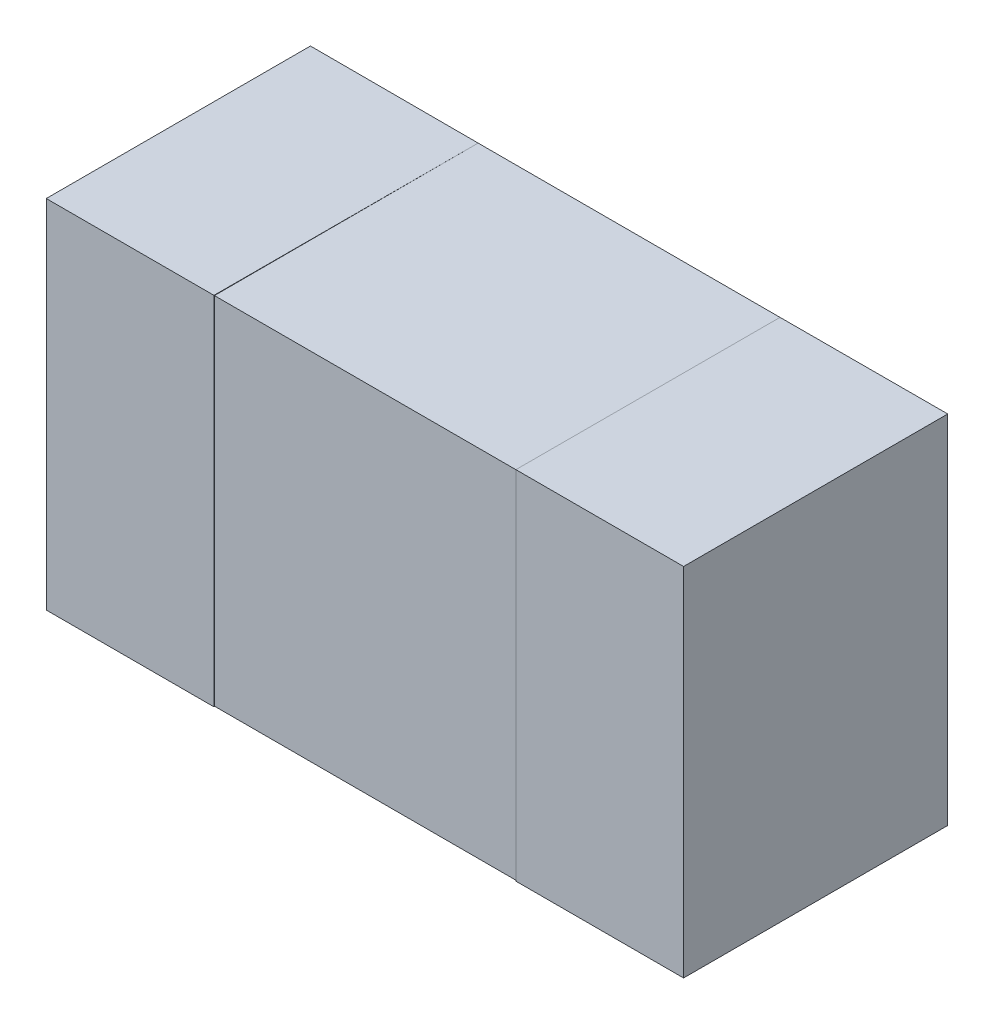
ISO-10303-21;
HEADER;
FILE_DESCRIPTION(('STEP AP214'),'2;1');
FILE_NAME('part.step','',(''),(''),'','','');
FILE_SCHEMA(('AUTOMOTIVE_DESIGN { 1 0 10303 214 1 1 1 1 }'));
ENDSEC;
DATA;
#1=APPLICATION_CONTEXT('core data for automotive mechanical design processes');
#2=APPLICATION_PROTOCOL_DEFINITION('international standard','automotive_design',2000,#1);
#3=PRODUCT_CONTEXT('',#1,'mechanical');
#4=PRODUCT('Part','Part','',(#3));
#5=PRODUCT_RELATED_PRODUCT_CATEGORY('part','',(#4));
#6=PRODUCT_DEFINITION_FORMATION('','',#4);
#7=PRODUCT_DEFINITION_CONTEXT('part definition',#1,'design');
#8=PRODUCT_DEFINITION('design','',#6,#7);
#9=PRODUCT_DEFINITION_SHAPE('','',#8);
#10=(LENGTH_UNIT() NAMED_UNIT(*) SI_UNIT(.MILLI.,.METRE.));
#11=(NAMED_UNIT(*) PLANE_ANGLE_UNIT() SI_UNIT($,.RADIAN.));
#12=(NAMED_UNIT(*) SI_UNIT($,.STERADIAN.) SOLID_ANGLE_UNIT());
#13=UNCERTAINTY_MEASURE_WITH_UNIT(LENGTH_MEASURE(1.E-05),#10,'distance_accuracy_value','');
#14=(GEOMETRIC_REPRESENTATION_CONTEXT(3) GLOBAL_UNCERTAINTY_ASSIGNED_CONTEXT((#13)) GLOBAL_UNIT_ASSIGNED_CONTEXT((#10,
#11,#12)) REPRESENTATION_CONTEXT('',''));
#15=CARTESIAN_POINT('',(0.,0.,0.));
#16=DIRECTION('',(0.,0.,1.));
#17=DIRECTION('',(1.,0.,0.));
#18=AXIS2_PLACEMENT_3D('',#15,#16,#17);
#19=CARTESIAN_POINT('',(0.358999999999954,-0.426,0.63));
#20=DIRECTION('',(0.,0.,1.));
#21=DIRECTION('',(1.,0.,0.));
#22=AXIS2_PLACEMENT_3D('',#19,#20,#21);
#23=PLANE('',#22);
#24=DIRECTION('',(0.,-1.,0.));
#25=VECTOR('',#24,1.);
#26=CARTESIAN_POINT('',(0.76,0.,0.63));
#27=LINE('',#26,#25);
#28=CARTESIAN_POINT('',(0.76,0.425,0.63));
#29=VERTEX_POINT('',#28);
#30=CARTESIAN_POINT('',(0.76,-0.425,0.63));
#31=VERTEX_POINT('',#30);
#32=EDGE_CURVE('E178',#29,#31,#27,.T.);
#33=ORIENTED_EDGE('',*,*,#32,.F.);
#34=DIRECTION('',(1.,0.,0.));
#35=VECTOR('',#34,1.);
#36=CARTESIAN_POINT('',(0.56,0.425,0.63));
#37=LINE('',#36,#35);
#38=CARTESIAN_POINT('',(0.36,0.425,0.63));
#39=VERTEX_POINT('',#38);
#40=EDGE_CURVE('E179',#39,#29,#37,.T.);
#41=ORIENTED_EDGE('',*,*,#40,.F.);
#42=DIRECTION('',(0.,-1.,0.));
#43=VECTOR('',#42,1.);
#44=CARTESIAN_POINT('',(0.36,0.426,0.63));
#45=LINE('',#44,#43);
#46=CARTESIAN_POINT('',(0.359999999999954,-0.425,0.63));
#47=VERTEX_POINT('',#46);
#48=EDGE_CURVE('E20',#47,#39,#45,.F.);
#49=ORIENTED_EDGE('',*,*,#48,.F.);
#50=DIRECTION('',(-1.,0.,0.));
#51=VECTOR('',#50,1.);
#52=CARTESIAN_POINT('',(0.56,-0.425,0.63));
#53=LINE('',#52,#51);
#54=EDGE_CURVE('E184',#31,#47,#53,.T.);
#55=ORIENTED_EDGE('',*,*,#54,.F.);
#56=EDGE_LOOP('',(#33,#41,#49,#55));
#57=FACE_BOUND('',#56,.T.);
#58=ADVANCED_FACE('F16',(#57),#23,.T.);
#59=CARTESIAN_POINT('',(0.36,0.426,-0.00100000000000003));
#60=DIRECTION('',(-1.,0.,0.));
#61=DIRECTION('',(0.,-1.,0.));
#62=AXIS2_PLACEMENT_3D('',#59,#60,#61);
#63=PLANE('',#62);
#64=DIRECTION('',(0.,0.,-1.));
#65=VECTOR('',#64,1.);
#66=CARTESIAN_POINT('',(0.359999999999954,-0.425,0.631));
#67=LINE('',#66,#65);
#68=CARTESIAN_POINT('',(0.359999999999985,-0.4245,0.));
#69=VERTEX_POINT('',#68);
#70=EDGE_CURVE('E168',#47,#69,#67,.T.);
#71=ORIENTED_EDGE('',*,*,#70,.F.);
#72=ORIENTED_EDGE('',*,*,#48,.T.);
#73=DIRECTION('',(0.,0.,1.));
#74=VECTOR('',#73,1.);
#75=CARTESIAN_POINT('',(0.36,0.425,-0.00100000000000003));
#76=LINE('',#75,#74);
#77=CARTESIAN_POINT('',(0.36,0.4245,0.));
#78=VERTEX_POINT('',#77);
#79=EDGE_CURVE('E191',#78,#39,#76,.T.);
#80=ORIENTED_EDGE('',*,*,#79,.F.);
#81=DIRECTION('',(0.,0.,1.));
#82=VECTOR('',#81,1.);
#83=CARTESIAN_POINT('',(0.36,0.424,-0.00100000000000003));
#84=LINE('',#83,#82);
#85=CARTESIAN_POINT('',(0.359999999999977,0.424,0.629));
#86=VERTEX_POINT('',#85);
#87=EDGE_CURVE('E35',#86,#78,#84,.F.);
#88=ORIENTED_EDGE('',*,*,#87,.F.);
#89=DIRECTION('',(0.,1.,0.));
#90=VECTOR('',#89,1.);
#91=CARTESIAN_POINT('',(0.359999999999954,-0.425,0.629));
#92=LINE('',#91,#90);
#93=CARTESIAN_POINT('',(0.359999999999954,-0.424,0.629));
#94=VERTEX_POINT('',#93);
#95=EDGE_CURVE('E163',#94,#86,#92,.T.);
#96=ORIENTED_EDGE('',*,*,#95,.F.);
#97=DIRECTION('',(0.,0.,-1.));
#98=VECTOR('',#97,1.);
#99=CARTESIAN_POINT('',(0.359999999999954,-0.424,0.63));
#100=LINE('',#99,#98);
#101=EDGE_CURVE('E214',#69,#94,#100,.F.);
#102=ORIENTED_EDGE('',*,*,#101,.F.);
#103=EDGE_LOOP('',(#71,#72,#80,#88,#96,#102));
#104=FACE_BOUND('',#103,.T.);
#105=ADVANCED_FACE('F234',(#104),#63,.T.);
#106=CARTESIAN_POINT('',(0.359,0.425,-0.00100000000000003));
#107=DIRECTION('',(0.,1.,0.));
#108=DIRECTION('',(0.,0.,1.));
#109=AXIS2_PLACEMENT_3D('',#106,#107,#108);
#110=PLANE('',#109);
#111=ORIENTED_EDGE('',*,*,#40,.T.);
#112=DIRECTION('',(0.,0.,1.));
#113=VECTOR('',#112,1.);
#114=CARTESIAN_POINT('',(0.76,0.425,0.315));
#115=LINE('',#114,#113);
#116=CARTESIAN_POINT('',(0.76,0.425,0.));
#117=VERTEX_POINT('',#116);
#118=EDGE_CURVE('E175',#117,#29,#115,.T.);
#119=ORIENTED_EDGE('',*,*,#118,.F.);
#120=DIRECTION('',(1.,0.,0.));
#121=VECTOR('',#120,1.);
#122=CARTESIAN_POINT('',(0.,0.425,0.));
#123=LINE('',#122,#121);
#124=EDGE_CURVE('E139',#78,#117,#123,.T.);
#125=ORIENTED_EDGE('',*,*,#124,.F.);
#126=ORIENTED_EDGE('',*,*,#79,.T.);
#127=EDGE_LOOP('',(#111,#119,#125,#126));
#128=FACE_BOUND('',#127,.T.);
#129=ADVANCED_FACE('F237',(#128),#110,.T.);
#130=CARTESIAN_POINT('',(0.76,-0.426,0.631));
#131=DIRECTION('',(1.,0.,0.));
#132=DIRECTION('',(0.,0.,-1.));
#133=AXIS2_PLACEMENT_3D('',#130,#131,#132);
#134=PLANE('',#133);
#135=ORIENTED_EDGE('',*,*,#32,.T.);
#136=DIRECTION('',(0.,0.,1.));
#137=VECTOR('',#136,1.);
#138=CARTESIAN_POINT('',(0.76,-0.425,0.315));
#139=LINE('',#138,#137);
#140=CARTESIAN_POINT('',(0.76,-0.425,0.));
#141=VERTEX_POINT('',#140);
#142=EDGE_CURVE('E165',#141,#31,#139,.T.);
#143=ORIENTED_EDGE('',*,*,#142,.F.);
#144=DIRECTION('',(0.,-1.,0.));
#145=VECTOR('',#144,1.);
#146=CARTESIAN_POINT('',(0.76,0.,0.));
#147=LINE('',#146,#145);
#148=EDGE_CURVE('E136',#117,#141,#147,.T.);
#149=ORIENTED_EDGE('',*,*,#148,.F.);
#150=ORIENTED_EDGE('',*,*,#118,.T.);
#151=EDGE_LOOP('',(#135,#143,#149,#150));
#152=FACE_BOUND('',#151,.T.);
#153=ADVANCED_FACE('F240',(#152),#134,.T.);
#154=CARTESIAN_POINT('',(0.359,-0.425,0.631));
#155=DIRECTION('',(0.,-1.,0.));
#156=DIRECTION('',(0.,0.,-1.));
#157=AXIS2_PLACEMENT_3D('',#154,#155,#156);
#158=PLANE('',#157);
#159=DIRECTION('',(-1.,0.,0.));
#160=VECTOR('',#159,1.);
#161=CARTESIAN_POINT('',(0.,-0.425,0.));
#162=LINE('',#161,#160);
#163=EDGE_CURVE('E128',#141,#69,#162,.T.);
#164=ORIENTED_EDGE('',*,*,#163,.F.);
#165=ORIENTED_EDGE('',*,*,#142,.T.);
#166=ORIENTED_EDGE('',*,*,#54,.T.);
#167=ORIENTED_EDGE('',*,*,#70,.T.);
#168=EDGE_LOOP('',(#164,#165,#166,#167));
#169=FACE_BOUND('',#168,.T.);
#170=ADVANCED_FACE('F258',(#169),#158,.T.);
#171=CARTESIAN_POINT('',(-0.361,0.424,-0.00100000000000003));
#172=DIRECTION('',(0.,1.,0.));
#173=DIRECTION('',(0.,0.,1.));
#174=AXIS2_PLACEMENT_3D('',#171,#172,#173);
#175=PLANE('',#174);
#176=ORIENTED_EDGE('',*,*,#87,.T.);
#177=DIRECTION('',(1.,0.,0.));
#178=VECTOR('',#177,1.);
#179=CARTESIAN_POINT('',(0.,0.424,0.));
#180=LINE('',#179,#178);
#181=CARTESIAN_POINT('',(-0.36,0.4245,0.));
#182=VERTEX_POINT('',#181);
#183=EDGE_CURVE('E142',#182,#78,#180,.T.);
#184=ORIENTED_EDGE('',*,*,#183,.F.);
#185=DIRECTION('',(0.,0.,-1.));
#186=VECTOR('',#185,1.);
#187=CARTESIAN_POINT('',(-0.36,0.424,0.631));
#188=LINE('',#187,#186);
#189=CARTESIAN_POINT('',(-0.36,0.424,0.629));
#190=VERTEX_POINT('',#189);
#191=EDGE_CURVE('E127',#190,#182,#188,.T.);
#192=ORIENTED_EDGE('',*,*,#191,.F.);
#193=DIRECTION('',(-1.,0.,0.));
#194=VECTOR('',#193,1.);
#195=CARTESIAN_POINT('',(0.,0.424,0.629));
#196=LINE('',#195,#194);
#197=EDGE_CURVE('E160',#86,#190,#196,.T.);
#198=ORIENTED_EDGE('',*,*,#197,.F.);
#199=EDGE_LOOP('',(#176,#184,#192,#198));
#200=FACE_BOUND('',#199,.T.);
#201=ADVANCED_FACE('F246',(#200),#175,.T.);
#202=CARTESIAN_POINT('',(-0.361,-0.424,0.63));
#203=DIRECTION('',(0.,-1.,0.));
#204=DIRECTION('',(0.,0.,-1.));
#205=AXIS2_PLACEMENT_3D('',#202,#203,#204);
#206=PLANE('',#205);
#207=DIRECTION('',(0.,0.,-1.));
#208=VECTOR('',#207,1.);
#209=CARTESIAN_POINT('',(-0.36,-0.424,0.631));
#210=LINE('',#209,#208);
#211=CARTESIAN_POINT('',(-0.36,-0.4245,0.));
#212=VERTEX_POINT('',#211);
#213=CARTESIAN_POINT('',(-0.36,-0.424,0.629));
#214=VERTEX_POINT('',#213);
#215=EDGE_CURVE('E199',#212,#214,#210,.F.);
#216=ORIENTED_EDGE('',*,*,#215,.F.);
#217=DIRECTION('',(-1.,0.,0.));
#218=VECTOR('',#217,1.);
#219=CARTESIAN_POINT('',(0.,-0.424,0.));
#220=LINE('',#219,#218);
#221=EDGE_CURVE('E147',#69,#212,#220,.T.);
#222=ORIENTED_EDGE('',*,*,#221,.F.);
#223=ORIENTED_EDGE('',*,*,#101,.T.);
#224=DIRECTION('',(1.,0.,0.));
#225=VECTOR('',#224,1.);
#226=CARTESIAN_POINT('',(0.,-0.424,0.629));
#227=LINE('',#226,#225);
#228=EDGE_CURVE('E151',#214,#94,#227,.T.);
#229=ORIENTED_EDGE('',*,*,#228,.F.);
#230=EDGE_LOOP('',(#216,#222,#223,#229));
#231=FACE_BOUND('',#230,.T.);
#232=ADVANCED_FACE('F256',(#231),#206,.T.);
#233=CARTESIAN_POINT('',(-0.361,-0.425,0.629));
#234=DIRECTION('',(0.,0.,1.));
#235=DIRECTION('',(1.,0.,0.));
#236=AXIS2_PLACEMENT_3D('',#233,#234,#235);
#237=PLANE('',#236);
#238=DIRECTION('',(0.,1.,0.));
#239=VECTOR('',#238,1.);
#240=CARTESIAN_POINT('',(-0.36,-0.426,0.629));
#241=LINE('',#240,#239);
#242=EDGE_CURVE('E195',#214,#190,#241,.T.);
#243=ORIENTED_EDGE('',*,*,#242,.F.);
#244=ORIENTED_EDGE('',*,*,#228,.T.);
#245=ORIENTED_EDGE('',*,*,#95,.T.);
#246=ORIENTED_EDGE('',*,*,#197,.T.);
#247=EDGE_LOOP('',(#243,#244,#245,#246));
#248=FACE_BOUND('',#247,.T.);
#249=ADVANCED_FACE('F253',(#248),#237,.T.);
#250=CARTESIAN_POINT('',(0.761,-0.426,0.));
#251=DIRECTION('',(0.,0.,-1.));
#252=DIRECTION('',(-1.,0.,0.));
#253=AXIS2_PLACEMENT_3D('',#250,#251,#252);
#254=PLANE('',#253);
#255=ORIENTED_EDGE('',*,*,#148,.T.);
#256=ORIENTED_EDGE('',*,*,#163,.T.);
#257=ORIENTED_EDGE('',*,*,#221,.T.);
#258=DIRECTION('',(1.,0.,0.));
#259=VECTOR('',#258,1.);
#260=CARTESIAN_POINT('',(-0.56,-0.425,0.));
#261=LINE('',#260,#259);
#262=CARTESIAN_POINT('',(-0.76,-0.425,0.));
#263=VERTEX_POINT('',#262);
#264=EDGE_CURVE('E124',#263,#212,#261,.T.);
#265=ORIENTED_EDGE('',*,*,#264,.F.);
#266=DIRECTION('',(0.,-1.,0.));
#267=VECTOR('',#266,1.);
#268=CARTESIAN_POINT('',(-0.76,0.,0.));
#269=LINE('',#268,#267);
#270=CARTESIAN_POINT('',(-0.76,0.425,0.));
#271=VERTEX_POINT('',#270);
#272=EDGE_CURVE('E119',#271,#263,#269,.T.);
#273=ORIENTED_EDGE('',*,*,#272,.F.);
#274=DIRECTION('',(-1.,0.,0.));
#275=VECTOR('',#274,1.);
#276=CARTESIAN_POINT('',(-0.56,0.425,0.));
#277=LINE('',#276,#275);
#278=EDGE_CURVE('E99',#182,#271,#277,.T.);
#279=ORIENTED_EDGE('',*,*,#278,.F.);
#280=ORIENTED_EDGE('',*,*,#183,.T.);
#281=ORIENTED_EDGE('',*,*,#124,.T.);
#282=EDGE_LOOP('',(#255,#256,#257,#265,#273,#279,#280,#281));
#283=FACE_BOUND('',#282,.T.);
#284=ADVANCED_FACE('F243',(#283),#254,.T.);
#285=CARTESIAN_POINT('',(-0.761,-0.425,0.631));
#286=DIRECTION('',(0.,-1.,0.));
#287=DIRECTION('',(0.,0.,-1.));
#288=AXIS2_PLACEMENT_3D('',#285,#286,#287);
#289=PLANE('',#288);
#290=DIRECTION('',(1.,0.,0.));
#291=VECTOR('',#290,1.);
#292=CARTESIAN_POINT('',(-0.56,-0.425,0.63));
#293=LINE('',#292,#291);
#294=CARTESIAN_POINT('',(-0.76,-0.425,0.63));
#295=VERTEX_POINT('',#294);
#296=CARTESIAN_POINT('',(-0.36,-0.425,0.63));
#297=VERTEX_POINT('',#296);
#298=EDGE_CURVE('E102',#295,#297,#293,.T.);
#299=ORIENTED_EDGE('',*,*,#298,.F.);
#300=DIRECTION('',(0.,0.,1.));
#301=VECTOR('',#300,1.);
#302=CARTESIAN_POINT('',(-0.76,-0.425,0.315));
#303=LINE('',#302,#301);
#304=EDGE_CURVE('E103',#263,#295,#303,.T.);
#305=ORIENTED_EDGE('',*,*,#304,.F.);
#306=ORIENTED_EDGE('',*,*,#264,.T.);
#307=DIRECTION('',(0.,0.,-1.));
#308=VECTOR('',#307,1.);
#309=CARTESIAN_POINT('',(-0.36,-0.425,0.631));
#310=LINE('',#309,#308);
#311=EDGE_CURVE('E201',#297,#212,#310,.T.);
#312=ORIENTED_EDGE('',*,*,#311,.F.);
#313=EDGE_LOOP('',(#299,#305,#306,#312));
#314=FACE_BOUND('',#313,.T.);
#315=ADVANCED_FACE('F279',(#314),#289,.T.);
#316=CARTESIAN_POINT('',(-0.36,-0.426,0.631));
#317=DIRECTION('',(1.,0.,0.));
#318=DIRECTION('',(0.,0.,-1.));
#319=AXIS2_PLACEMENT_3D('',#316,#317,#318);
#320=PLANE('',#319);
#321=ORIENTED_EDGE('',*,*,#215,.T.);
#322=ORIENTED_EDGE('',*,*,#242,.T.);
#323=ORIENTED_EDGE('',*,*,#191,.T.);
#324=DIRECTION('',(0.,0.,1.));
#325=VECTOR('',#324,1.);
#326=CARTESIAN_POINT('',(-0.36,0.425,-0.00100000000000003));
#327=LINE('',#326,#325);
#328=CARTESIAN_POINT('',(-0.36,0.425,0.63));
#329=VERTEX_POINT('',#328);
#330=EDGE_CURVE('E155',#329,#182,#327,.F.);
#331=ORIENTED_EDGE('',*,*,#330,.F.);
#332=DIRECTION('',(0.,1.,0.));
#333=VECTOR('',#332,1.);
#334=CARTESIAN_POINT('',(-0.36,-0.426,0.63));
#335=LINE('',#334,#333);
#336=EDGE_CURVE('E111',#297,#329,#335,.T.);
#337=ORIENTED_EDGE('',*,*,#336,.F.);
#338=ORIENTED_EDGE('',*,*,#311,.T.);
#339=EDGE_LOOP('',(#321,#322,#323,#331,#337,#338));
#340=FACE_BOUND('',#339,.T.);
#341=ADVANCED_FACE('F248',(#340),#320,.T.);
#342=CARTESIAN_POINT('',(-0.761,0.425,-0.00100000000000003));
#343=DIRECTION('',(0.,1.,0.));
#344=DIRECTION('',(0.,0.,1.));
#345=AXIS2_PLACEMENT_3D('',#342,#343,#344);
#346=PLANE('',#345);
#347=ORIENTED_EDGE('',*,*,#278,.T.);
#348=DIRECTION('',(0.,0.,-1.));
#349=VECTOR('',#348,1.);
#350=CARTESIAN_POINT('',(-0.76,0.425,0.315));
#351=LINE('',#350,#349);
#352=CARTESIAN_POINT('',(-0.76,0.425,0.63));
#353=VERTEX_POINT('',#352);
#354=EDGE_CURVE('E92',#353,#271,#351,.T.);
#355=ORIENTED_EDGE('',*,*,#354,.F.);
#356=DIRECTION('',(-1.,0.,0.));
#357=VECTOR('',#356,1.);
#358=CARTESIAN_POINT('',(-0.56,0.425,0.63));
#359=LINE('',#358,#357);
#360=EDGE_CURVE('E26',#329,#353,#359,.T.);
#361=ORIENTED_EDGE('',*,*,#360,.F.);
#362=ORIENTED_EDGE('',*,*,#330,.T.);
#363=EDGE_LOOP('',(#347,#355,#361,#362));
#364=FACE_BOUND('',#363,.T.);
#365=ADVANCED_FACE('F94',(#364),#346,.T.);
#366=CARTESIAN_POINT('',(-0.76,0.426,-0.00100000000000003));
#367=DIRECTION('',(-1.,0.,0.));
#368=DIRECTION('',(0.,-1.,0.));
#369=AXIS2_PLACEMENT_3D('',#366,#367,#368);
#370=PLANE('',#369);
#371=DIRECTION('',(0.,-1.,0.));
#372=VECTOR('',#371,1.);
#373=CARTESIAN_POINT('',(-0.76,0.,0.63));
#374=LINE('',#373,#372);
#375=EDGE_CURVE('E11',#353,#295,#374,.T.);
#376=ORIENTED_EDGE('',*,*,#375,.F.);
#377=ORIENTED_EDGE('',*,*,#354,.T.);
#378=ORIENTED_EDGE('',*,*,#272,.T.);
#379=ORIENTED_EDGE('',*,*,#304,.T.);
#380=EDGE_LOOP('',(#376,#377,#378,#379));
#381=FACE_BOUND('',#380,.T.);
#382=ADVANCED_FACE('F106',(#381),#370,.T.);
#383=CARTESIAN_POINT('',(-0.761,-0.426,0.63));
#384=DIRECTION('',(0.,0.,1.));
#385=DIRECTION('',(1.,0.,0.));
#386=AXIS2_PLACEMENT_3D('',#383,#384,#385);
#387=PLANE('',#386);
#388=ORIENTED_EDGE('',*,*,#360,.T.);
#389=ORIENTED_EDGE('',*,*,#375,.T.);
#390=ORIENTED_EDGE('',*,*,#298,.T.);
#391=ORIENTED_EDGE('',*,*,#336,.T.);
#392=EDGE_LOOP('',(#388,#389,#390,#391));
#393=FACE_BOUND('',#392,.T.);
#394=ADVANCED_FACE('F18',(#393),#387,.T.);
#395=CLOSED_SHELL('',(#58,#105,#129,#153,#170,#201,#232,#249,#284,#315,#341,#365,#382,#394));
#396=MANIFOLD_SOLID_BREP('B1',#395);
#397=ADVANCED_BREP_SHAPE_REPRESENTATION('',(#18,#396),#14);
#398=SHAPE_DEFINITION_REPRESENTATION(#9,#397);
ENDSEC;
END-ISO-10303-21;
